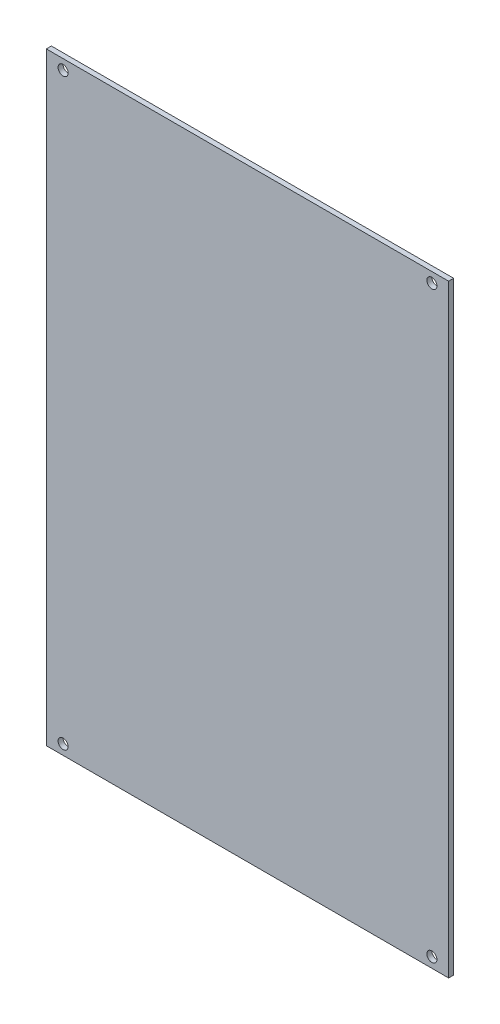
ISO-10303-21;
HEADER;
FILE_DESCRIPTION(('STEP AP214'),'2;1');
FILE_NAME('part.step','',(''),(''),'','','');
FILE_SCHEMA(('AUTOMOTIVE_DESIGN { 1 0 10303 214 1 1 1 1 }'));
ENDSEC;
DATA;
#1=APPLICATION_CONTEXT('core data for automotive mechanical design processes');
#2=APPLICATION_PROTOCOL_DEFINITION('international standard','automotive_design',2000,#1);
#3=PRODUCT_CONTEXT('',#1,'mechanical');
#4=PRODUCT('Part','Part','',(#3));
#5=PRODUCT_RELATED_PRODUCT_CATEGORY('part','',(#4));
#6=PRODUCT_DEFINITION_FORMATION('','',#4);
#7=PRODUCT_DEFINITION_CONTEXT('part definition',#1,'design');
#8=PRODUCT_DEFINITION('design','',#6,#7);
#9=PRODUCT_DEFINITION_SHAPE('','',#8);
#10=(LENGTH_UNIT() NAMED_UNIT(*) SI_UNIT(.MILLI.,.METRE.));
#11=(NAMED_UNIT(*) PLANE_ANGLE_UNIT() SI_UNIT($,.RADIAN.));
#12=(NAMED_UNIT(*) SI_UNIT($,.STERADIAN.) SOLID_ANGLE_UNIT());
#13=UNCERTAINTY_MEASURE_WITH_UNIT(LENGTH_MEASURE(1.E-05),#10,'distance_accuracy_value','');
#14=(GEOMETRIC_REPRESENTATION_CONTEXT(3) GLOBAL_UNCERTAINTY_ASSIGNED_CONTEXT((#13)) GLOBAL_UNIT_ASSIGNED_CONTEXT((#10,
#11,#12)) REPRESENTATION_CONTEXT('',''));
#15=CARTESIAN_POINT('',(0.,0.,0.));
#16=DIRECTION('',(0.,0.,1.));
#17=DIRECTION('',(1.,0.,0.));
#18=AXIS2_PLACEMENT_3D('',#15,#16,#17);
#19=CARTESIAN_POINT('',(3745.41238066885,8.65166213414813,2.25));
#20=DIRECTION('',(0.,0.,-1.));
#21=DIRECTION('',(-1.,0.,0.));
#22=AXIS2_PLACEMENT_3D('',#19,#20,#21);
#23=PLANE('',#22);
#24=DIRECTION('',(-1.,0.,0.));
#25=VECTOR('',#24,1.);
#26=CARTESIAN_POINT('',(4101.56931185428,99.6129579268313,2.25));
#27=LINE('',#26,#25);
#28=CARTESIAN_POINT('',(4221.56931185428,99.6129579268313,2.25));
#29=VERTEX_POINT('',#28);
#30=CARTESIAN_POINT('',(4101.56931185428,99.6129579268313,2.25));
#31=VERTEX_POINT('',#30);
#32=EDGE_CURVE('E93',#29,#31,#27,.T.);
#33=ORIENTED_EDGE('',*,*,#32,.T.);
#34=DIRECTION('',(0.,-1.,0.));
#35=VECTOR('',#34,1.);
#36=CARTESIAN_POINT('',(4101.56931185428,99.6129579268313,2.25));
#37=LINE('',#36,#35);
#38=CARTESIAN_POINT('',(4101.56931185428,-80.3870420731688,2.25));
#39=VERTEX_POINT('',#38);
#40=EDGE_CURVE('E133',#31,#39,#37,.T.);
#41=ORIENTED_EDGE('',*,*,#40,.T.);
#42=DIRECTION('',(1.,0.,0.));
#43=VECTOR('',#42,1.);
#44=CARTESIAN_POINT('',(4101.56931185428,-80.3870420731688,2.25));
#45=LINE('',#44,#43);
#46=CARTESIAN_POINT('',(4221.56931185428,-80.3870420731688,2.25));
#47=VERTEX_POINT('',#46);
#48=EDGE_CURVE('E87',#39,#47,#45,.T.);
#49=ORIENTED_EDGE('',*,*,#48,.T.);
#50=DIRECTION('',(0.,1.,0.));
#51=VECTOR('',#50,1.);
#52=CARTESIAN_POINT('',(4221.56931185428,99.6129579268313,2.25));
#53=LINE('',#52,#51);
#54=EDGE_CURVE('E53',#47,#29,#53,.T.);
#55=ORIENTED_EDGE('',*,*,#54,.T.);
#56=EDGE_LOOP('',(#33,#41,#49,#55));
#57=FACE_BOUND('',#56,.T.);
#58=CARTESIAN_POINT('',(4106.56931185428,96.6129579268313,2.25));
#59=DIRECTION('',(0.,0.,1.));
#60=DIRECTION('',(1.,0.,0.));
#61=AXIS2_PLACEMENT_3D('',#58,#59,#60);
#62=CIRCLE('',#61,1.50000000000006);
#63=CARTESIAN_POINT('',(4108.06931185428,96.6129579268313,2.25));
#64=VERTEX_POINT('',#63);
#65=EDGE_CURVE('E117',#64,#64,#62,.T.);
#66=ORIENTED_EDGE('',*,*,#65,.F.);
#67=EDGE_LOOP('',(#66));
#68=FACE_BOUND('',#67,.T.);
#69=CARTESIAN_POINT('',(4216.56931185428,96.6129579268312,2.25));
#70=DIRECTION('',(0.,0.,1.));
#71=DIRECTION('',(1.,0.,0.));
#72=AXIS2_PLACEMENT_3D('',#69,#70,#71);
#73=CIRCLE('',#72,1.5000000000005);
#74=CARTESIAN_POINT('',(4218.06931185428,96.6129579268312,2.25));
#75=VERTEX_POINT('',#74);
#76=EDGE_CURVE('E100',#75,#75,#73,.T.);
#77=ORIENTED_EDGE('',*,*,#76,.F.);
#78=EDGE_LOOP('',(#77));
#79=FACE_BOUND('',#78,.T.);
#80=CARTESIAN_POINT('',(4106.56931185428,-77.3870420731688,2.25));
#81=DIRECTION('',(0.,0.,1.));
#82=DIRECTION('',(1.,0.,0.));
#83=AXIS2_PLACEMENT_3D('',#80,#81,#82);
#84=CIRCLE('',#83,1.50000000000006);
#85=CARTESIAN_POINT('',(4108.06931185428,-77.3870420731688,2.25));
#86=VERTEX_POINT('',#85);
#87=EDGE_CURVE('E101',#86,#86,#84,.T.);
#88=ORIENTED_EDGE('',*,*,#87,.F.);
#89=EDGE_LOOP('',(#88));
#90=FACE_BOUND('',#89,.T.);
#91=CARTESIAN_POINT('',(4216.56931185428,-77.3870420731688,2.25));
#92=DIRECTION('',(0.,0.,1.));
#93=DIRECTION('',(1.,0.,0.));
#94=AXIS2_PLACEMENT_3D('',#91,#92,#93);
#95=CIRCLE('',#94,1.50000000000006);
#96=CARTESIAN_POINT('',(4218.06931185428,-77.3870420731688,2.25));
#97=VERTEX_POINT('',#96);
#98=EDGE_CURVE('E104',#97,#97,#95,.T.);
#99=ORIENTED_EDGE('',*,*,#98,.F.);
#100=EDGE_LOOP('',(#99));
#101=FACE_BOUND('',#100,.T.);
#102=ADVANCED_FACE('F34',(#57,#68,#79,#90,#101),#23,.F.);
#103=CARTESIAN_POINT('',(3745.41238066885,8.65166213414813,0.75));
#104=DIRECTION('',(0.,0.,-1.));
#105=DIRECTION('',(-1.,0.,0.));
#106=AXIS2_PLACEMENT_3D('',#103,#104,#105);
#107=PLANE('',#106);
#108=CARTESIAN_POINT('',(4106.56931185428,-77.3870420731688,0.75));
#109=DIRECTION('',(0.,0.,1.));
#110=DIRECTION('',(1.,0.,0.));
#111=AXIS2_PLACEMENT_3D('',#108,#109,#110);
#112=CIRCLE('',#111,1.50000000000006);
#113=CARTESIAN_POINT('',(4108.06931185428,-77.3870420731688,0.75));
#114=VERTEX_POINT('',#113);
#115=EDGE_CURVE('E108',#114,#114,#112,.T.);
#116=ORIENTED_EDGE('',*,*,#115,.T.);
#117=EDGE_LOOP('',(#116));
#118=FACE_BOUND('',#117,.T.);
#119=CARTESIAN_POINT('',(4106.56931185428,96.6129579268313,0.75));
#120=DIRECTION('',(0.,0.,1.));
#121=DIRECTION('',(1.,0.,0.));
#122=AXIS2_PLACEMENT_3D('',#119,#120,#121);
#123=CIRCLE('',#122,1.50000000000006);
#124=CARTESIAN_POINT('',(4108.06931185428,96.6129579268313,0.75));
#125=VERTEX_POINT('',#124);
#126=EDGE_CURVE('E121',#125,#125,#123,.T.);
#127=ORIENTED_EDGE('',*,*,#126,.T.);
#128=EDGE_LOOP('',(#127));
#129=FACE_BOUND('',#128,.T.);
#130=DIRECTION('',(-1.,0.,0.));
#131=VECTOR('',#130,1.);
#132=CARTESIAN_POINT('',(4101.56931185428,99.6129579268313,0.75));
#133=LINE('',#132,#131);
#134=CARTESIAN_POINT('',(4221.56931185428,99.6129579268313,0.75));
#135=VERTEX_POINT('',#134);
#136=CARTESIAN_POINT('',(4101.56931185428,99.6129579268313,0.75));
#137=VERTEX_POINT('',#136);
#138=EDGE_CURVE('E81',#135,#137,#133,.T.);
#139=ORIENTED_EDGE('',*,*,#138,.F.);
#140=DIRECTION('',(0.,1.,0.));
#141=VECTOR('',#140,1.);
#142=CARTESIAN_POINT('',(4221.56931185428,99.6129579268313,0.75));
#143=LINE('',#142,#141);
#144=CARTESIAN_POINT('',(4221.56931185428,-80.3870420731688,0.75));
#145=VERTEX_POINT('',#144);
#146=EDGE_CURVE('E91',#145,#135,#143,.T.);
#147=ORIENTED_EDGE('',*,*,#146,.F.);
#148=DIRECTION('',(1.,0.,0.));
#149=VECTOR('',#148,1.);
#150=CARTESIAN_POINT('',(4101.56931185428,-80.3870420731688,0.75));
#151=LINE('',#150,#149);
#152=CARTESIAN_POINT('',(4101.56931185428,-80.3870420731688,0.75));
#153=VERTEX_POINT('',#152);
#154=EDGE_CURVE('E80',#153,#145,#151,.T.);
#155=ORIENTED_EDGE('',*,*,#154,.F.);
#156=DIRECTION('',(0.,-1.,0.));
#157=VECTOR('',#156,1.);
#158=CARTESIAN_POINT('',(4101.56931185428,99.6129579268313,0.75));
#159=LINE('',#158,#157);
#160=EDGE_CURVE('E71',#137,#153,#159,.T.);
#161=ORIENTED_EDGE('',*,*,#160,.F.);
#162=EDGE_LOOP('',(#139,#147,#155,#161));
#163=FACE_BOUND('',#162,.T.);
#164=CARTESIAN_POINT('',(4216.56931185428,96.6129579268312,0.75));
#165=DIRECTION('',(0.,0.,1.));
#166=DIRECTION('',(1.,0.,0.));
#167=AXIS2_PLACEMENT_3D('',#164,#165,#166);
#168=CIRCLE('',#167,1.5000000000005);
#169=CARTESIAN_POINT('',(4218.06931185428,96.6129579268312,0.75));
#170=VERTEX_POINT('',#169);
#171=EDGE_CURVE('E97',#170,#170,#168,.T.);
#172=ORIENTED_EDGE('',*,*,#171,.T.);
#173=EDGE_LOOP('',(#172));
#174=FACE_BOUND('',#173,.T.);
#175=CARTESIAN_POINT('',(4216.56931185428,-77.3870420731688,0.75));
#176=DIRECTION('',(0.,0.,1.));
#177=DIRECTION('',(1.,0.,0.));
#178=AXIS2_PLACEMENT_3D('',#175,#176,#177);
#179=CIRCLE('',#178,1.50000000000006);
#180=CARTESIAN_POINT('',(4218.06931185428,-77.3870420731688,0.75));
#181=VERTEX_POINT('',#180);
#182=EDGE_CURVE('E102',#181,#181,#179,.T.);
#183=ORIENTED_EDGE('',*,*,#182,.T.);
#184=EDGE_LOOP('',(#183));
#185=FACE_BOUND('',#184,.T.);
#186=ADVANCED_FACE('F89',(#118,#129,#163,#174,#185),#107,.T.);
#187=CARTESIAN_POINT('',(4101.56931185428,99.6129579268313,2.25));
#188=DIRECTION('',(0.,-1.,0.));
#189=DIRECTION('',(0.,0.,-1.));
#190=AXIS2_PLACEMENT_3D('',#187,#188,#189);
#191=PLANE('',#190);
#192=ORIENTED_EDGE('',*,*,#138,.T.);
#193=DIRECTION('',(0.,0.,-1.));
#194=VECTOR('',#193,1.);
#195=CARTESIAN_POINT('',(4101.56931185428,99.6129579268313,2.25));
#196=LINE('',#195,#194);
#197=EDGE_CURVE('E11',#31,#137,#196,.T.);
#198=ORIENTED_EDGE('',*,*,#197,.F.);
#199=ORIENTED_EDGE('',*,*,#32,.F.);
#200=DIRECTION('',(0.,0.,-1.));
#201=VECTOR('',#200,1.);
#202=CARTESIAN_POINT('',(4221.56931185428,99.6129579268313,2.25));
#203=LINE('',#202,#201);
#204=EDGE_CURVE('E119',#29,#135,#203,.T.);
#205=ORIENTED_EDGE('',*,*,#204,.T.);
#206=EDGE_LOOP('',(#192,#198,#199,#205));
#207=FACE_BOUND('',#206,.T.);
#208=ADVANCED_FACE('F139',(#207),#191,.F.);
#209=CARTESIAN_POINT('',(4101.56931185428,99.6129579268313,2.25));
#210=DIRECTION('',(1.,0.,0.));
#211=DIRECTION('',(0.,0.,-1.));
#212=AXIS2_PLACEMENT_3D('',#209,#210,#211);
#213=PLANE('',#212);
#214=ORIENTED_EDGE('',*,*,#160,.T.);
#215=DIRECTION('',(0.,0.,-1.));
#216=VECTOR('',#215,1.);
#217=CARTESIAN_POINT('',(4101.56931185428,-80.3870420731688,2.25));
#218=LINE('',#217,#216);
#219=EDGE_CURVE('E44',#39,#153,#218,.T.);
#220=ORIENTED_EDGE('',*,*,#219,.F.);
#221=ORIENTED_EDGE('',*,*,#40,.F.);
#222=ORIENTED_EDGE('',*,*,#197,.T.);
#223=EDGE_LOOP('',(#214,#220,#221,#222));
#224=FACE_BOUND('',#223,.T.);
#225=ADVANCED_FACE('F75',(#224),#213,.F.);
#226=CARTESIAN_POINT('',(4101.56931185428,-80.3870420731688,2.25));
#227=DIRECTION('',(0.,1.,0.));
#228=DIRECTION('',(0.,0.,1.));
#229=AXIS2_PLACEMENT_3D('',#226,#227,#228);
#230=PLANE('',#229);
#231=ORIENTED_EDGE('',*,*,#154,.T.);
#232=DIRECTION('',(0.,0.,-1.));
#233=VECTOR('',#232,1.);
#234=CARTESIAN_POINT('',(4221.56931185428,-80.3870420731688,2.25));
#235=LINE('',#234,#233);
#236=EDGE_CURVE('E38',#47,#145,#235,.T.);
#237=ORIENTED_EDGE('',*,*,#236,.F.);
#238=ORIENTED_EDGE('',*,*,#48,.F.);
#239=ORIENTED_EDGE('',*,*,#219,.T.);
#240=EDGE_LOOP('',(#231,#237,#238,#239));
#241=FACE_BOUND('',#240,.T.);
#242=ADVANCED_FACE('F84',(#241),#230,.F.);
#243=CARTESIAN_POINT('',(4221.56931185428,99.6129579268313,2.25));
#244=DIRECTION('',(-1.,0.,0.));
#245=DIRECTION('',(0.,0.,1.));
#246=AXIS2_PLACEMENT_3D('',#243,#244,#245);
#247=PLANE('',#246);
#248=ORIENTED_EDGE('',*,*,#146,.T.);
#249=ORIENTED_EDGE('',*,*,#204,.F.);
#250=ORIENTED_EDGE('',*,*,#54,.F.);
#251=ORIENTED_EDGE('',*,*,#236,.T.);
#252=EDGE_LOOP('',(#248,#249,#250,#251));
#253=FACE_BOUND('',#252,.T.);
#254=ADVANCED_FACE('F141',(#253),#247,.F.);
#255=CARTESIAN_POINT('',(4106.56931185428,96.6129579268313,2.25));
#256=DIRECTION('',(0.,0.,-1.));
#257=DIRECTION('',(-1.,0.,0.));
#258=AXIS2_PLACEMENT_3D('',#255,#256,#257);
#259=CYLINDRICAL_SURFACE('',#258,1.50000000000006);
#260=ORIENTED_EDGE('',*,*,#65,.T.);
#261=EDGE_LOOP('',(#260));
#262=FACE_BOUND('',#261,.T.);
#263=ORIENTED_EDGE('',*,*,#126,.F.);
#264=EDGE_LOOP('',(#263));
#265=FACE_BOUND('',#264,.T.);
#266=ADVANCED_FACE('F143',(#262,#265),#259,.F.);
#267=CARTESIAN_POINT('',(4216.56931185428,96.6129579268312,2.25));
#268=DIRECTION('',(0.,0.,-1.));
#269=DIRECTION('',(-1.,0.,0.));
#270=AXIS2_PLACEMENT_3D('',#267,#268,#269);
#271=CYLINDRICAL_SURFACE('',#270,1.5000000000005);
#272=ORIENTED_EDGE('',*,*,#76,.T.);
#273=EDGE_LOOP('',(#272));
#274=FACE_BOUND('',#273,.T.);
#275=ORIENTED_EDGE('',*,*,#171,.F.);
#276=EDGE_LOOP('',(#275));
#277=FACE_BOUND('',#276,.T.);
#278=ADVANCED_FACE('F149',(#274,#277),#271,.F.);
#279=CARTESIAN_POINT('',(4106.56931185428,-77.3870420731688,2.25));
#280=DIRECTION('',(0.,0.,-1.));
#281=DIRECTION('',(-1.,0.,0.));
#282=AXIS2_PLACEMENT_3D('',#279,#280,#281);
#283=CYLINDRICAL_SURFACE('',#282,1.50000000000006);
#284=ORIENTED_EDGE('',*,*,#87,.T.);
#285=EDGE_LOOP('',(#284));
#286=FACE_BOUND('',#285,.T.);
#287=ORIENTED_EDGE('',*,*,#115,.F.);
#288=EDGE_LOOP('',(#287));
#289=FACE_BOUND('',#288,.T.);
#290=ADVANCED_FACE('F193',(#286,#289),#283,.F.);
#291=CARTESIAN_POINT('',(4216.56931185428,-77.3870420731688,2.25));
#292=DIRECTION('',(0.,0.,-1.));
#293=DIRECTION('',(-1.,0.,0.));
#294=AXIS2_PLACEMENT_3D('',#291,#292,#293);
#295=CYLINDRICAL_SURFACE('',#294,1.50000000000006);
#296=ORIENTED_EDGE('',*,*,#98,.T.);
#297=EDGE_LOOP('',(#296));
#298=FACE_BOUND('',#297,.T.);
#299=ORIENTED_EDGE('',*,*,#182,.F.);
#300=EDGE_LOOP('',(#299));
#301=FACE_BOUND('',#300,.T.);
#302=ADVANCED_FACE('F36',(#298,#301),#295,.F.);
#303=CLOSED_SHELL('',(#102,#186,#208,#225,#242,#254,#266,#278,#290,#302));
#304=MANIFOLD_SOLID_BREP('B2',#303);
#305=ADVANCED_BREP_SHAPE_REPRESENTATION('',(#18,#304),#14);
#306=SHAPE_DEFINITION_REPRESENTATION(#9,#305);
ENDSEC;
END-ISO-10303-21;
